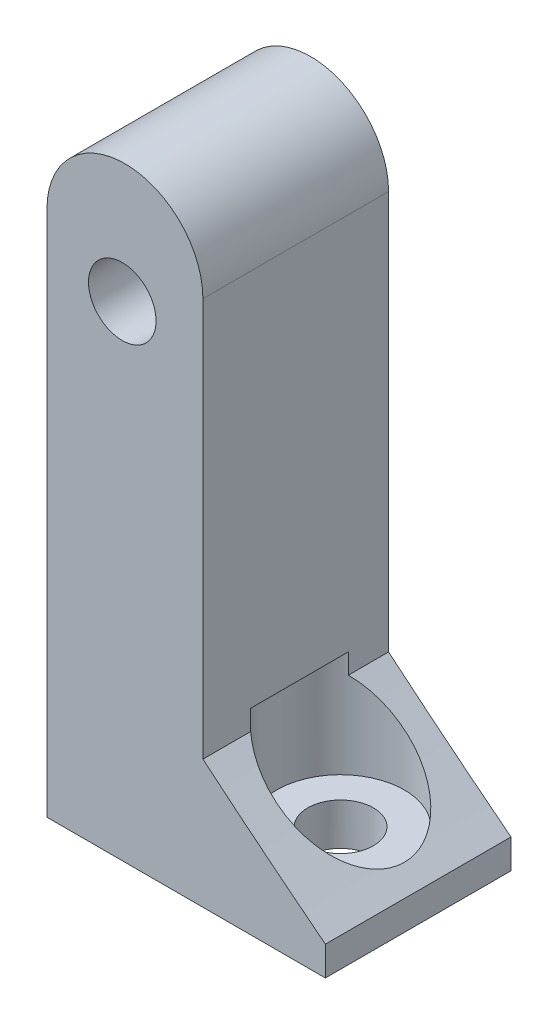
ISO-10303-21;
HEADER;
FILE_DESCRIPTION(('STEP AP214'),'2;1');
FILE_NAME('part.step','',(''),(''),'','','');
FILE_SCHEMA(('AUTOMOTIVE_DESIGN { 1 0 10303 214 1 1 1 1 }'));
ENDSEC;
DATA;
#1=APPLICATION_CONTEXT('core data for automotive mechanical design processes');
#2=APPLICATION_PROTOCOL_DEFINITION('international standard','automotive_design',2000,#1);
#3=PRODUCT_CONTEXT('',#1,'mechanical');
#4=PRODUCT('Part','Part','',(#3));
#5=PRODUCT_RELATED_PRODUCT_CATEGORY('part','',(#4));
#6=PRODUCT_DEFINITION_FORMATION('','',#4);
#7=PRODUCT_DEFINITION_CONTEXT('part definition',#1,'design');
#8=PRODUCT_DEFINITION('design','',#6,#7);
#9=PRODUCT_DEFINITION_SHAPE('','',#8);
#10=(LENGTH_UNIT() NAMED_UNIT(*) SI_UNIT(.MILLI.,.METRE.));
#11=(NAMED_UNIT(*) PLANE_ANGLE_UNIT() SI_UNIT($,.RADIAN.));
#12=(NAMED_UNIT(*) SI_UNIT($,.STERADIAN.) SOLID_ANGLE_UNIT());
#13=UNCERTAINTY_MEASURE_WITH_UNIT(LENGTH_MEASURE(1.E-05),#10,'distance_accuracy_value','');
#14=(GEOMETRIC_REPRESENTATION_CONTEXT(3) GLOBAL_UNCERTAINTY_ASSIGNED_CONTEXT((#13)) GLOBAL_UNIT_ASSIGNED_CONTEXT((#10,
#11,#12)) REPRESENTATION_CONTEXT('',''));
#15=CARTESIAN_POINT('',(0.,0.,0.));
#16=DIRECTION('',(0.,0.,1.));
#17=DIRECTION('',(1.,0.,0.));
#18=AXIS2_PLACEMENT_3D('',#15,#16,#17);
#19=CARTESIAN_POINT('',(148.277410490779,278.616785564438,274.974983990308));
#20=DIRECTION('',(0.,0.,-1.));
#21=DIRECTION('',(-1.,0.,0.));
#22=AXIS2_PLACEMENT_3D('',#19,#20,#21);
#23=PLANE('',#22);
#24=DIRECTION('',(-1.,-2.30194384614848E-10,0.));
#25=VECTOR('',#24,1.);
#26=CARTESIAN_POINT('',(136.390210490779,280.597985564438,274.974983990309));
#27=LINE('',#26,#25);
#28=CARTESIAN_POINT('',(148.277410489396,280.597985567175,274.974983990308));
#29=VERTEX_POINT('',#28);
#30=CARTESIAN_POINT('',(129.232034092559,280.597985567175,274.974983990309));
#31=VERTEX_POINT('',#30);
#32=EDGE_CURVE('E101',#29,#31,#27,.T.);
#33=ORIENTED_EDGE('',*,*,#32,.T.);
#34=DIRECTION('',(0.,1.,0.));
#35=VECTOR('',#34,1.);
#36=CARTESIAN_POINT('',(129.232034092559,277.111994181974,274.974983990309));
#37=LINE('',#36,#35);
#38=CARTESIAN_POINT('',(129.232034092559,316.653648996608,274.974983990308));
#39=VERTEX_POINT('',#38);
#40=EDGE_CURVE('E104',#31,#39,#37,.T.);
#41=ORIENTED_EDGE('',*,*,#40,.T.);
#42=CARTESIAN_POINT('',(134.566034092559,316.653648996608,274.974983990308));
#43=DIRECTION('',(0.,0.,-1.));
#44=DIRECTION('',(1.,0.,0.));
#45=AXIS2_PLACEMENT_3D('',#42,#43,#44);
#46=CIRCLE('',#45,5.33399999999999);
#47=CARTESIAN_POINT('',(139.900034092559,316.653648996608,274.974983990308));
#48=VERTEX_POINT('',#47);
#49=EDGE_CURVE('E118',#39,#48,#46,.T.);
#50=ORIENTED_EDGE('',*,*,#49,.T.);
#51=DIRECTION('',(0.,-1.,0.));
#52=VECTOR('',#51,1.);
#53=CARTESIAN_POINT('',(139.900034092559,289.37501380209,274.974983990308));
#54=LINE('',#53,#52);
#55=CARTESIAN_POINT('',(139.900034092559,289.37501380209,274.974983990308));
#56=VERTEX_POINT('',#55);
#57=EDGE_CURVE('E120',#48,#56,#54,.T.);
#58=ORIENTED_EDGE('',*,*,#57,.T.);
#59=CARTESIAN_POINT('',(324.782733258538,509.579936367551,274.974983990304));
#60=DIRECTION('',(0.,0.,1.));
#61=DIRECTION('',(1.,0.,0.));
#62=AXIS2_PLACEMENT_3D('',#59,#60,#61);
#63=CIRCLE('',#62,287.527077634365);
#64=CARTESIAN_POINT('',(148.277410489394,282.60484652922,274.974983990308));
#65=VERTEX_POINT('',#64);
#66=EDGE_CURVE('E125',#56,#65,#63,.T.);
#67=ORIENTED_EDGE('',*,*,#66,.T.);
#68=DIRECTION('',(0.,1.,0.));
#69=VECTOR('',#68,1.);
#70=CARTESIAN_POINT('',(148.277410489396,282.60484652922,274.974983990308));
#71=LINE('',#70,#69);
#72=EDGE_CURVE('E107',#29,#65,#71,.T.);
#73=ORIENTED_EDGE('',*,*,#72,.F.);
#74=EDGE_LOOP('',(#33,#41,#50,#58,#67,#73));
#75=FACE_BOUND('',#74,.T.);
#76=CARTESIAN_POINT('',(134.383610490779,313.727499575974,274.974983990308));
#77=DIRECTION('',(0.,0.,-1.));
#78=DIRECTION('',(-1.,0.,0.));
#79=AXIS2_PLACEMENT_3D('',#76,#77,#78);
#80=CIRCLE('',#79,2.31139999999999);
#81=CARTESIAN_POINT('',(132.072210490779,313.727499575974,274.974983990308));
#82=VERTEX_POINT('',#81);
#83=EDGE_CURVE('E130',#82,#82,#80,.T.);
#84=ORIENTED_EDGE('',*,*,#83,.F.);
#85=EDGE_LOOP('',(#84));
#86=FACE_BOUND('',#85,.T.);
#87=ADVANCED_FACE('F33',(#75,#86),#23,.T.);
#88=CARTESIAN_POINT('',(148.277410490779,278.616785564439,287.674983990308));
#89=DIRECTION('',(0.,0.,-1.));
#90=DIRECTION('',(-1.,0.,0.));
#91=AXIS2_PLACEMENT_3D('',#88,#89,#90);
#92=PLANE('',#91);
#93=DIRECTION('',(0.,1.,0.));
#94=VECTOR('',#93,1.);
#95=CARTESIAN_POINT('',(129.232034092559,277.111994181974,287.674983990309));
#96=LINE('',#95,#94);
#97=CARTESIAN_POINT('',(129.232034092559,280.597985567175,287.674983990309));
#98=VERTEX_POINT('',#97);
#99=CARTESIAN_POINT('',(129.232034092559,316.653648996608,287.674983990308));
#100=VERTEX_POINT('',#99);
#101=EDGE_CURVE('E129',#98,#100,#96,.T.);
#102=ORIENTED_EDGE('',*,*,#101,.F.);
#103=DIRECTION('',(-1.,-2.30194384614848E-10,0.));
#104=VECTOR('',#103,1.);
#105=CARTESIAN_POINT('',(136.390210490779,280.597985564438,287.674983990309));
#106=LINE('',#105,#104);
#107=CARTESIAN_POINT('',(148.277410489396,280.597985567175,287.674983990308));
#108=VERTEX_POINT('',#107);
#109=EDGE_CURVE('E48',#108,#98,#106,.T.);
#110=ORIENTED_EDGE('',*,*,#109,.F.);
#111=DIRECTION('',(0.,1.,0.));
#112=VECTOR('',#111,1.);
#113=CARTESIAN_POINT('',(148.277410489396,282.60484652922,287.674983990308));
#114=LINE('',#113,#112);
#115=CARTESIAN_POINT('',(148.277410489396,282.60484652922,287.674983990308));
#116=VERTEX_POINT('',#115);
#117=EDGE_CURVE('E214',#108,#116,#114,.T.);
#118=ORIENTED_EDGE('',*,*,#117,.T.);
#119=CARTESIAN_POINT('',(324.782733258538,509.579936367551,287.674983990304));
#120=DIRECTION('',(0.,0.,1.));
#121=DIRECTION('',(1.,0.,0.));
#122=AXIS2_PLACEMENT_3D('',#119,#120,#121);
#123=CIRCLE('',#122,287.527077634365);
#124=CARTESIAN_POINT('',(139.900034092559,289.37501380209,287.674983990308));
#125=VERTEX_POINT('',#124);
#126=EDGE_CURVE('E108',#125,#116,#123,.T.);
#127=ORIENTED_EDGE('',*,*,#126,.F.);
#128=DIRECTION('',(0.,-1.,0.));
#129=VECTOR('',#128,1.);
#130=CARTESIAN_POINT('',(139.900034092559,289.37501380209,287.674983990308));
#131=LINE('',#130,#129);
#132=CARTESIAN_POINT('',(139.900034092559,316.653648996608,287.674983990308));
#133=VERTEX_POINT('',#132);
#134=EDGE_CURVE('E134',#133,#125,#131,.T.);
#135=ORIENTED_EDGE('',*,*,#134,.F.);
#136=CARTESIAN_POINT('',(134.566034092559,316.653648996608,287.674983990308));
#137=DIRECTION('',(0.,0.,-1.));
#138=DIRECTION('',(1.,0.,0.));
#139=AXIS2_PLACEMENT_3D('',#136,#137,#138);
#140=CIRCLE('',#139,5.33399999999999);
#141=EDGE_CURVE('E132',#100,#133,#140,.T.);
#142=ORIENTED_EDGE('',*,*,#141,.F.);
#143=EDGE_LOOP('',(#102,#110,#118,#127,#135,#142));
#144=FACE_BOUND('',#143,.T.);
#145=CARTESIAN_POINT('',(134.383610490779,313.727499575974,287.674983990308));
#146=DIRECTION('',(0.,0.,-1.));
#147=DIRECTION('',(-1.,0.,0.));
#148=AXIS2_PLACEMENT_3D('',#145,#146,#147);
#149=CIRCLE('',#148,2.31139999999999);
#150=CARTESIAN_POINT('',(132.072210490779,313.727499575974,287.674983990308));
#151=VERTEX_POINT('',#150);
#152=EDGE_CURVE('E194',#151,#151,#149,.T.);
#153=ORIENTED_EDGE('',*,*,#152,.T.);
#154=EDGE_LOOP('',(#153));
#155=FACE_BOUND('',#154,.T.);
#156=ADVANCED_FACE('F183',(#144,#155),#92,.F.);
#157=CARTESIAN_POINT('',(136.390210490779,280.597985564438,274.974983990309));
#158=DIRECTION('',(-2.30194384614848E-10,1.,0.));
#159=DIRECTION('',(-1.,-2.30194384614848E-10,0.));
#160=AXIS2_PLACEMENT_3D('',#157,#158,#159);
#161=PLANE('',#160);
#162=CARTESIAN_POINT('',(142.70800089523,280.597985565893,281.067357508984));
#163=DIRECTION('',(-2.30194384614848E-10,1.,0.));
#164=DIRECTION('',(-1.,-2.30194384614848E-10,0.));
#165=AXIS2_PLACEMENT_3D('',#162,#163,#164);
#166=CIRCLE('',#165,2.2479);
#167=CARTESIAN_POINT('',(140.46010089523,280.597985565375,281.067357508984));
#168=VERTEX_POINT('',#167);
#169=EDGE_CURVE('E196',#168,#168,#166,.T.);
#170=ORIENTED_EDGE('',*,*,#169,.T.);
#171=EDGE_LOOP('',(#170));
#172=FACE_BOUND('',#171,.T.);
#173=ORIENTED_EDGE('',*,*,#109,.T.);
#174=DIRECTION('',(0.,0.,1.));
#175=VECTOR('',#174,1.);
#176=CARTESIAN_POINT('',(129.232034092559,280.597985567175,274.974983990309));
#177=LINE('',#176,#175);
#178=EDGE_CURVE('E110',#31,#98,#177,.T.);
#179=ORIENTED_EDGE('',*,*,#178,.F.);
#180=ORIENTED_EDGE('',*,*,#32,.F.);
#181=DIRECTION('',(0.,0.,1.));
#182=VECTOR('',#181,1.);
#183=CARTESIAN_POINT('',(148.277410490779,280.597985567175,274.974983990308));
#184=LINE('',#183,#182);
#185=EDGE_CURVE('E148',#29,#108,#184,.T.);
#186=ORIENTED_EDGE('',*,*,#185,.T.);
#187=EDGE_LOOP('',(#173,#179,#180,#186));
#188=FACE_BOUND('',#187,.T.);
#189=ADVANCED_FACE('F35',(#172,#188),#161,.F.);
#190=CARTESIAN_POINT('',(129.232034092559,277.111994181974,274.974983990309));
#191=DIRECTION('',(1.,0.,0.));
#192=DIRECTION('',(0.,0.,-1.));
#193=AXIS2_PLACEMENT_3D('',#190,#191,#192);
#194=PLANE('',#193);
#195=ORIENTED_EDGE('',*,*,#40,.F.);
#196=ORIENTED_EDGE('',*,*,#178,.T.);
#197=ORIENTED_EDGE('',*,*,#101,.T.);
#198=DIRECTION('',(0.,0.,1.));
#199=VECTOR('',#198,1.);
#200=CARTESIAN_POINT('',(129.232034092559,316.653648996608,274.974983990308));
#201=LINE('',#200,#199);
#202=EDGE_CURVE('E116',#39,#100,#201,.T.);
#203=ORIENTED_EDGE('',*,*,#202,.F.);
#204=EDGE_LOOP('',(#195,#196,#197,#203));
#205=FACE_BOUND('',#204,.T.);
#206=ADVANCED_FACE('F114',(#205),#194,.F.);
#207=CARTESIAN_POINT('',(134.566034092559,316.653648996608,274.974983990308));
#208=DIRECTION('',(0.,0.,1.));
#209=DIRECTION('',(1.,0.,0.));
#210=AXIS2_PLACEMENT_3D('',#207,#208,#209);
#211=CYLINDRICAL_SURFACE('',#210,5.33399999999999);
#212=ORIENTED_EDGE('',*,*,#141,.T.);
#213=DIRECTION('',(0.,0.,1.));
#214=VECTOR('',#213,1.);
#215=CARTESIAN_POINT('',(139.900034092559,316.653648996608,274.974983990308));
#216=LINE('',#215,#214);
#217=EDGE_CURVE('E144',#48,#133,#216,.T.);
#218=ORIENTED_EDGE('',*,*,#217,.F.);
#219=ORIENTED_EDGE('',*,*,#49,.F.);
#220=ORIENTED_EDGE('',*,*,#202,.T.);
#221=EDGE_LOOP('',(#212,#218,#219,#220));
#222=FACE_BOUND('',#221,.T.);
#223=ADVANCED_FACE('F229',(#222),#211,.T.);
#224=CARTESIAN_POINT('',(139.900034092559,289.37501380209,274.974983990308));
#225=DIRECTION('',(-1.,0.,0.));
#226=DIRECTION('',(0.,0.,1.));
#227=AXIS2_PLACEMENT_3D('',#224,#225,#226);
#228=PLANE('',#227);
#229=DIRECTION('',(0.,0.,1.));
#230=VECTOR('',#229,1.);
#231=CARTESIAN_POINT('',(139.900034092559,289.37501380209,274.974983990308));
#232=LINE('',#231,#230);
#233=CARTESIAN_POINT('',(139.900034092559,289.37501380209,284.410940739996));
#234=VERTEX_POINT('',#233);
#235=EDGE_CURVE('E140',#234,#125,#232,.T.);
#236=ORIENTED_EDGE('',*,*,#235,.F.);
#237=DIRECTION('',(0.,1.,0.));
#238=VECTOR('',#237,1.);
#239=CARTESIAN_POINT('',(139.900034092559,290.757985564438,284.410940739996));
#240=LINE('',#239,#238);
#241=CARTESIAN_POINT('',(139.900034092559,290.757985564438,284.410940739996));
#242=VERTEX_POINT('',#241);
#243=EDGE_CURVE('E56',#234,#242,#240,.T.);
#244=ORIENTED_EDGE('',*,*,#243,.T.);
#245=DIRECTION('',(0.,0.,-1.));
#246=VECTOR('',#245,1.);
#247=CARTESIAN_POINT('',(139.900034092559,290.757985564438,274.974983990308));
#248=LINE('',#247,#246);
#249=CARTESIAN_POINT('',(139.900034092559,290.757985564438,277.723774277973));
#250=VERTEX_POINT('',#249);
#251=EDGE_CURVE('E11',#242,#250,#248,.T.);
#252=ORIENTED_EDGE('',*,*,#251,.T.);
#253=DIRECTION('',(0.,1.,0.));
#254=VECTOR('',#253,1.);
#255=CARTESIAN_POINT('',(139.900034092559,290.757985564438,277.723774277973));
#256=LINE('',#255,#254);
#257=CARTESIAN_POINT('',(139.900034092559,289.37501380209,277.723774277973));
#258=VERTEX_POINT('',#257);
#259=EDGE_CURVE('E203',#250,#258,#256,.F.);
#260=ORIENTED_EDGE('',*,*,#259,.T.);
#261=EDGE_CURVE('E141',#56,#258,#232,.T.);
#262=ORIENTED_EDGE('',*,*,#261,.F.);
#263=ORIENTED_EDGE('',*,*,#57,.F.);
#264=ORIENTED_EDGE('',*,*,#217,.T.);
#265=ORIENTED_EDGE('',*,*,#134,.T.);
#266=EDGE_LOOP('',(#236,#244,#252,#260,#262,#263,#264,#265));
#267=FACE_BOUND('',#266,.T.);
#268=ADVANCED_FACE('F225',(#267),#228,.F.);
#269=CARTESIAN_POINT('',(324.782733258538,509.579936367551,274.974983990304));
#270=DIRECTION('',(0.,0.,1.));
#271=DIRECTION('',(1.,0.,0.));
#272=AXIS2_PLACEMENT_3D('',#269,#270,#271);
#273=CYLINDRICAL_SURFACE('',#272,287.527077634365);
#274=ORIENTED_EDGE('',*,*,#261,.T.);
#275=CARTESIAN_POINT('',(139.900034092559,289.37501380209,277.723774277973));
#276=CARTESIAN_POINT('',(140.020178136506,289.274139124035,277.622911074198));
#277=CARTESIAN_POINT('',(140.14412540019,289.170243736454,277.529821138289));
#278=CARTESIAN_POINT('',(140.398115694955,288.957724719936,277.35897349964));
#279=CARTESIAN_POINT('',(140.528152214352,288.849106150333,277.281199861479));
#280=CARTESIAN_POINT('',(140.792470995981,288.628735175518,277.140877448431));
#281=CARTESIAN_POINT('',(140.926731502876,288.516999084429,277.078261692991));
#282=CARTESIAN_POINT('',(141.198953765668,288.290877331118,276.967527392474));
#283=CARTESIAN_POINT('',(141.336916532157,288.176490946642,276.919412850496));
#284=CARTESIAN_POINT('',(141.744575058752,287.839155598594,276.799540276713));
#285=CARTESIAN_POINT('',(142.018060592213,287.613673831873,276.747090000591));
#286=CARTESIAN_POINT('',(142.569392014515,287.160858399288,276.694500594212));
#287=CARTESIAN_POINT('',(142.847245944374,286.933521813473,276.694473029938));
#288=CARTESIAN_POINT('',(143.281366529639,286.579676975514,276.736020923954));
#289=CARTESIAN_POINT('',(143.438464617782,286.451908308112,276.759685330058));
#290=CARTESIAN_POINT('',(143.75074100518,286.198471770582,276.824435923058));
#291=CARTESIAN_POINT('',(143.905918944666,286.072804292639,276.865525325408));
#292=CARTESIAN_POINT('',(144.366247690407,285.70080314349,277.015402632281));
#293=CARTESIAN_POINT('',(144.667001062899,285.458812730254,277.150871861479));
#294=CARTESIAN_POINT('',(145.160382196321,285.063340604772,277.446892553003));
#295=CARTESIAN_POINT('',(145.359468207996,284.904234045878,277.58940750804));
#296=CARTESIAN_POINT('',(145.737624103765,284.602765699921,277.913406087008));
#297=CARTESIAN_POINT('',(145.916723584198,284.460379136859,278.094830896515));
#298=CARTESIAN_POINT('',(146.215097021217,284.223665401816,278.458022847108));
#299=CARTESIAN_POINT('',(146.339264684816,284.125352730132,278.633112216863));
#300=CARTESIAN_POINT('',(146.507506719476,283.992327852124,278.913317476048));
#301=CARTESIAN_POINT('',(146.56060443415,283.950378921666,279.009692176804));
#302=CARTESIAN_POINT('',(146.660084372372,283.871836520962,279.207910876316));
#303=CARTESIAN_POINT('',(146.706469621625,283.835240637699,279.309752382301));
#304=CARTESIAN_POINT('',(146.792205607131,283.767634993147,279.519316453199));
#305=CARTESIAN_POINT('',(146.831489580428,283.736678229295,279.627083541475));
#306=CARTESIAN_POINT('',(146.901794435852,283.681299848516,279.846856789601));
#307=CARTESIAN_POINT('',(146.932819700556,283.656874765446,279.958860664964));
#308=CARTESIAN_POINT('',(146.986009582115,283.615013046598,280.186173419319));
#309=CARTESIAN_POINT('',(147.008178912737,283.597572693032,280.301480504981));
#310=CARTESIAN_POINT('',(147.04320510437,283.570022855782,280.534358324806));
#311=CARTESIAN_POINT('',(147.056063512628,283.559912154092,280.651928679536));
#312=CARTESIAN_POINT('',(147.071055690415,283.548124223343,280.871547795159));
#313=CARTESIAN_POINT('',(147.074440553641,283.545463165321,280.97346111603));
#314=CARTESIAN_POINT('',(147.074066491605,283.545757248435,281.177301517587));
#315=CARTESIAN_POINT('',(147.070305346997,283.548714134343,281.279228592714));
#316=CARTESIAN_POINT('',(147.055698481241,283.560199243623,281.482200124927));
#317=CARTESIAN_POINT('',(147.044856886309,283.568724222125,281.583245061355));
#318=CARTESIAN_POINT('',(147.016280825593,283.591199737964,281.783756638112));
#319=CARTESIAN_POINT('',(146.998543735314,283.605152341111,281.883222662468));
#320=CARTESIAN_POINT('',(146.937318250953,283.653330132665,282.169070893502));
#321=CARTESIAN_POINT('',(146.885060760836,283.694467647058,282.35251966454));
#322=CARTESIAN_POINT('',(146.75914121218,283.793693623591,282.706853852826));
#323=CARTESIAN_POINT('',(146.685476052345,283.851784541749,282.877737445279));
#324=CARTESIAN_POINT('',(146.512358949656,283.988475520549,283.219331967931));
#325=CARTESIAN_POINT('',(146.411165882892,284.068464512734,283.388600561758));
#326=CARTESIAN_POINT('',(146.191225650093,284.242603643912,283.707234103877));
#327=CARTESIAN_POINT('',(146.072464354977,284.336765182115,283.856582846249));
#328=CARTESIAN_POINT('',(145.764485568995,284.5814003358,284.197204157333));
#329=CARTESIAN_POINT('',(145.567612369909,284.738146348623,284.377098267314));
#330=CARTESIAN_POINT('',(145.15410179812,285.068365552744,284.693488884851));
#331=CARTESIAN_POINT('',(144.937436509379,285.241862390733,284.829922838222));
#332=CARTESIAN_POINT('',(144.488464544358,285.602524448487,285.062215996012));
#333=CARTESIAN_POINT('',(144.255984356044,285.789844261278,285.157494216956));
#334=CARTESIAN_POINT('',(143.78375105726,286.17160803632,285.306262009051));
#335=CARTESIAN_POINT('',(143.543996176836,286.36605373475,285.359741324332));
#336=CARTESIAN_POINT('',(143.010328225894,286.800325213673,285.433139188628));
#337=CARTESIAN_POINT('',(142.715762756435,287.040990572831,285.44347611724));
#338=CARTESIAN_POINT('',(142.129877278764,287.521615343211,285.405112497984));
#339=CARTESIAN_POINT('',(141.838556322478,287.76157494473,285.356429678627));
#340=CARTESIAN_POINT('',(141.406416577316,288.118916765745,285.237863875542));
#341=CARTESIAN_POINT('',(141.261524286887,288.238975796648,285.189917638044));
#342=CARTESIAN_POINT('',(140.975637822123,288.476326090788,285.078178216835));
#343=CARTESIAN_POINT('',(140.834642481814,288.593618180326,285.01438983143));
#344=CARTESIAN_POINT('',(140.557392610565,288.824694494366,284.870460530964));
#345=CARTESIAN_POINT('',(140.421152719443,288.938467781344,284.790273577544));
#346=CARTESIAN_POINT('',(140.155234048331,289.160932321626,284.613212442164));
#347=CARTESIAN_POINT('',(140.02556299029,289.269617582851,284.516319184356));
#348=CARTESIAN_POINT('',(139.900034092559,289.37501380209,284.410940739996));
#349=B_SPLINE_CURVE_WITH_KNOTS('',3,(#275,#276,#277,#278,#279,#280,#281,#282,#283,#284,#285,
#286,#287,#288,#289,#290,#291,#292,#293,#294,#295,#296,#297,#298,#299,#300,#301,#302,#303,#304,
#305,#306,#307,#308,#309,#310,#311,#312,#313,#314,#315,#316,#317,#318,#319,#320,#321,#322,#323,
#324,#325,#326,#327,#328,#329,#330,#331,#332,#333,#334,#335,#336,#337,#338,#339,#340,#341,#342,
#343,#344,#345,#346,#347,#348),.UNSPECIFIED.,.F.,.F.,(4,2,2,2,2,2,2,2,2,2,2,2,2,2,2,2,2,2,2,2,2,
2,2,2,2,2,2,2,2,2,2,2,2,2,2,2,4),(0.,0.55911083902828,1.11763685710263,1.67364783212226,
2.22981215516365,3.30051336855465,4.37349324509618,4.98439891642483,5.59541736790578,
6.81436223270239,7.68728511860142,8.55889771699725,9.26410957416886,9.61701367911154,
9.96975821046588,10.3256637740658,10.6813800941495,11.0369068233036,11.3923744591253,
11.6979933118338,12.003707096554,12.3092428817677,12.6148950710105,13.1975801308216,
13.7803496454134,14.4163657433654,15.0528961604862,15.9758725619872,16.9001715047678,
17.8371229578418,18.7743042312658,19.9112194436951,21.0477932310935,21.6297596234268,
22.2115499629284,22.7949966499452,23.3791140030323),.UNSPECIFIED.);
#350=EDGE_CURVE('E41',#258,#234,#349,.T.);
#351=ORIENTED_EDGE('',*,*,#350,.T.);
#352=ORIENTED_EDGE('',*,*,#235,.T.);
#353=ORIENTED_EDGE('',*,*,#126,.T.);
#354=DIRECTION('',(0.,0.,1.));
#355=VECTOR('',#354,1.);
#356=CARTESIAN_POINT('',(148.277410489394,282.60484652922,274.974983990308));
#357=LINE('',#356,#355);
#358=EDGE_CURVE('E127',#65,#116,#357,.T.);
#359=ORIENTED_EDGE('',*,*,#358,.F.);
#360=ORIENTED_EDGE('',*,*,#66,.F.);
#361=EDGE_LOOP('',(#274,#351,#352,#353,#359,#360));
#362=FACE_BOUND('',#361,.T.);
#363=ADVANCED_FACE('F155',(#362),#273,.F.);
#364=CARTESIAN_POINT('',(134.383610490779,313.727499575974,274.974983990308));
#365=DIRECTION('',(0.,0.,1.));
#366=DIRECTION('',(1.,0.,0.));
#367=AXIS2_PLACEMENT_3D('',#364,#365,#366);
#368=CYLINDRICAL_SURFACE('',#367,2.31139999999999);
#369=ORIENTED_EDGE('',*,*,#83,.T.);
#370=EDGE_LOOP('',(#369));
#371=FACE_BOUND('',#370,.T.);
#372=ORIENTED_EDGE('',*,*,#152,.F.);
#373=EDGE_LOOP('',(#372));
#374=FACE_BOUND('',#373,.T.);
#375=ADVANCED_FACE('F174',(#371,#374),#368,.F.);
#376=CARTESIAN_POINT('',(142.70800089523,290.757985564438,281.067357508984));
#377=DIRECTION('',(0.,1.,0.));
#378=DIRECTION('',(0.,0.,1.));
#379=AXIS2_PLACEMENT_3D('',#376,#377,#378);
#380=CYLINDRICAL_SURFACE('',#379,2.2479);
#381=CARTESIAN_POINT('',(142.70800089523,283.468185564438,281.067357508984));
#382=DIRECTION('',(0.,1.,0.));
#383=DIRECTION('',(0.,0.,1.));
#384=AXIS2_PLACEMENT_3D('',#381,#382,#383);
#385=CIRCLE('',#384,2.2479);
#386=CARTESIAN_POINT('',(142.70800089523,283.468185564438,283.315257508984));
#387=VERTEX_POINT('',#386);
#388=EDGE_CURVE('E206',#387,#387,#385,.T.);
#389=ORIENTED_EDGE('',*,*,#388,.T.);
#390=EDGE_LOOP('',(#389));
#391=FACE_BOUND('',#390,.T.);
#392=ORIENTED_EDGE('',*,*,#169,.F.);
#393=EDGE_LOOP('',(#392));
#394=FACE_BOUND('',#393,.T.);
#395=ADVANCED_FACE('F170',(#391,#394),#380,.F.);
#396=CARTESIAN_POINT('',(144.95590089523,283.468185564438,281.067357508984));
#397=DIRECTION('',(0.,-1.,0.));
#398=DIRECTION('',(0.,0.,-1.));
#399=AXIS2_PLACEMENT_3D('',#396,#397,#398);
#400=PLANE('',#399);
#401=ORIENTED_EDGE('',*,*,#388,.F.);
#402=EDGE_LOOP('',(#401));
#403=FACE_BOUND('',#402,.T.);
#404=CARTESIAN_POINT('',(142.70800089523,283.468185564438,281.067357508984));
#405=DIRECTION('',(0.,1.,0.));
#406=DIRECTION('',(0.,0.,1.));
#407=AXIS2_PLACEMENT_3D('',#404,#405,#406);
#408=CIRCLE('',#407,4.36626000000001);
#409=CARTESIAN_POINT('',(142.70800089523,283.468185564438,285.433617508984));
#410=VERTEX_POINT('',#409);
#411=EDGE_CURVE('E209',#410,#410,#408,.T.);
#412=ORIENTED_EDGE('',*,*,#411,.T.);
#413=EDGE_LOOP('',(#412));
#414=FACE_BOUND('',#413,.T.);
#415=ADVANCED_FACE('F165',(#403,#414),#400,.F.);
#416=CARTESIAN_POINT('',(142.70800089523,290.757985564438,281.067357508984));
#417=DIRECTION('',(0.,1.,0.));
#418=DIRECTION('',(0.,0.,1.));
#419=AXIS2_PLACEMENT_3D('',#416,#417,#418);
#420=CYLINDRICAL_SURFACE('',#419,4.36626);
#421=ORIENTED_EDGE('',*,*,#411,.F.);
#422=EDGE_LOOP('',(#421));
#423=FACE_BOUND('',#422,.T.);
#424=ORIENTED_EDGE('',*,*,#350,.F.);
#425=ORIENTED_EDGE('',*,*,#259,.F.);
#426=CARTESIAN_POINT('',(142.70800089523,290.757985564438,281.067357508984));
#427=DIRECTION('',(0.,1.,0.));
#428=DIRECTION('',(0.,0.,1.));
#429=AXIS2_PLACEMENT_3D('',#426,#427,#428);
#430=CIRCLE('',#429,4.36625999999998);
#431=EDGE_CURVE('E212',#250,#242,#430,.T.);
#432=ORIENTED_EDGE('',*,*,#431,.T.);
#433=ORIENTED_EDGE('',*,*,#243,.F.);
#434=EDGE_LOOP('',(#424,#425,#432,#433));
#435=FACE_BOUND('',#434,.T.);
#436=ADVANCED_FACE('F159',(#423,#435),#420,.F.);
#437=CARTESIAN_POINT('',(147.07426089523,290.757985564438,281.067357508984));
#438=DIRECTION('',(0.,1.,0.));
#439=DIRECTION('',(0.,0.,1.));
#440=AXIS2_PLACEMENT_3D('',#437,#438,#439);
#441=PLANE('',#440);
#442=ORIENTED_EDGE('',*,*,#431,.F.);
#443=ORIENTED_EDGE('',*,*,#251,.F.);
#444=EDGE_LOOP('',(#442,#443));
#445=FACE_BOUND('',#444,.T.);
#446=ADVANCED_FACE('F164',(#445),#441,.F.);
#447=CARTESIAN_POINT('',(148.277410489396,282.60484652922,287.674983990308));
#448=DIRECTION('',(-1.,0.,0.));
#449=DIRECTION('',(0.,0.,1.));
#450=AXIS2_PLACEMENT_3D('',#447,#448,#449);
#451=PLANE('',#450);
#452=ORIENTED_EDGE('',*,*,#72,.T.);
#453=ORIENTED_EDGE('',*,*,#358,.T.);
#454=ORIENTED_EDGE('',*,*,#117,.F.);
#455=ORIENTED_EDGE('',*,*,#185,.F.);
#456=EDGE_LOOP('',(#452,#453,#454,#455));
#457=FACE_BOUND('',#456,.T.);
#458=ADVANCED_FACE('F167',(#457),#451,.F.);
#459=CLOSED_SHELL('',(#87,#156,#189,#206,#223,#268,#363,#375,#395,#415,#436,#446,#458));
#460=MANIFOLD_SOLID_BREP('B2',#459);
#461=ADVANCED_BREP_SHAPE_REPRESENTATION('',(#18,#460),#14);
#462=SHAPE_DEFINITION_REPRESENTATION(#9,#461);
ENDSEC;
END-ISO-10303-21;
